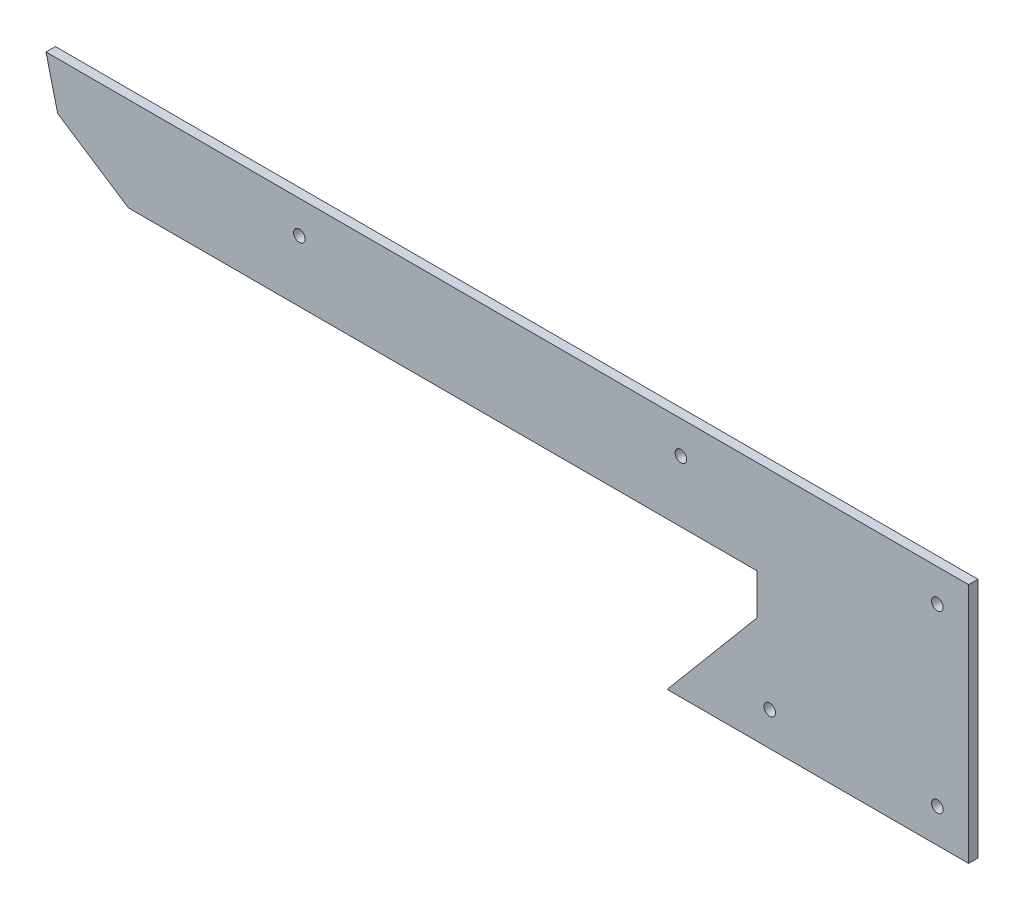
ISO-10303-21;
HEADER;
FILE_DESCRIPTION(('STEP AP214'),'2;1');
FILE_NAME('part.step','',(''),(''),'','','');
FILE_SCHEMA(('AUTOMOTIVE_DESIGN { 1 0 10303 214 1 1 1 1 }'));
ENDSEC;
DATA;
#1=APPLICATION_CONTEXT('core data for automotive mechanical design processes');
#2=APPLICATION_PROTOCOL_DEFINITION('international standard','automotive_design',2000,#1);
#3=PRODUCT_CONTEXT('',#1,'mechanical');
#4=PRODUCT('Part','Part','',(#3));
#5=PRODUCT_RELATED_PRODUCT_CATEGORY('part','',(#4));
#6=PRODUCT_DEFINITION_FORMATION('','',#4);
#7=PRODUCT_DEFINITION_CONTEXT('part definition',#1,'design');
#8=PRODUCT_DEFINITION('design','',#6,#7);
#9=PRODUCT_DEFINITION_SHAPE('','',#8);
#10=(LENGTH_UNIT() NAMED_UNIT(*) SI_UNIT(.MILLI.,.METRE.));
#11=(NAMED_UNIT(*) PLANE_ANGLE_UNIT() SI_UNIT($,.RADIAN.));
#12=(NAMED_UNIT(*) SI_UNIT($,.STERADIAN.) SOLID_ANGLE_UNIT());
#13=UNCERTAINTY_MEASURE_WITH_UNIT(LENGTH_MEASURE(1.E-05),#10,'distance_accuracy_value','');
#14=(GEOMETRIC_REPRESENTATION_CONTEXT(3) GLOBAL_UNCERTAINTY_ASSIGNED_CONTEXT((#13)) GLOBAL_UNIT_ASSIGNED_CONTEXT((#10,
#11,#12)) REPRESENTATION_CONTEXT('',''));
#15=CARTESIAN_POINT('',(0.,0.,0.));
#16=DIRECTION('',(0.,0.,1.));
#17=DIRECTION('',(1.,0.,0.));
#18=AXIS2_PLACEMENT_3D('',#15,#16,#17);
#19=CARTESIAN_POINT('',(0.,0.,15.));
#20=DIRECTION('',(0.,0.,-1.));
#21=DIRECTION('',(-1.,0.,0.));
#22=AXIS2_PLACEMENT_3D('',#19,#20,#21);
#23=PLANE('',#22);
#24=DIRECTION('',(0.239129123428334,-0.970987776611218,0.));
#25=VECTOR('',#24,1.);
#26=CARTESIAN_POINT('',(18.7206297064588,-76.0154277941144,15.));
#27=LINE('',#26,#25);
#28=CARTESIAN_POINT('',(0.,0.,15.));
#29=VERTEX_POINT('',#28);
#30=CARTESIAN_POINT('',(18.7206297064588,-76.0154277941144,15.));
#31=VERTEX_POINT('',#30);
#32=EDGE_CURVE('E150',#29,#31,#27,.T.);
#33=ORIENTED_EDGE('',*,*,#32,.T.);
#34=DIRECTION('',(0.836895874462482,-0.547362124473074,0.));
#35=VECTOR('',#34,1.);
#36=CARTESIAN_POINT('',(131.840227290203,-150.,15.));
#37=LINE('',#36,#35);
#38=CARTESIAN_POINT('',(131.840227290203,-150.,15.));
#39=VERTEX_POINT('',#38);
#40=EDGE_CURVE('E98',#31,#39,#37,.T.);
#41=ORIENTED_EDGE('',*,*,#40,.T.);
#42=DIRECTION('',(1.,0.,0.));
#43=VECTOR('',#42,1.);
#44=CARTESIAN_POINT('',(1136.8402272902,-150.,15.));
#45=LINE('',#44,#43);
#46=CARTESIAN_POINT('',(1136.8402272902,-150.,15.));
#47=VERTEX_POINT('',#46);
#48=EDGE_CURVE('E165',#39,#47,#45,.T.);
#49=ORIENTED_EDGE('',*,*,#48,.T.);
#50=DIRECTION('',(0.,-1.,0.));
#51=VECTOR('',#50,1.);
#52=CARTESIAN_POINT('',(1136.8402272902,-215.015424523064,15.));
#53=LINE('',#52,#51);
#54=CARTESIAN_POINT('',(1136.8402272902,-215.015424523064,15.));
#55=VERTEX_POINT('',#54);
#56=EDGE_CURVE('E178',#47,#55,#53,.T.);
#57=ORIENTED_EDGE('',*,*,#56,.T.);
#58=DIRECTION('',(-0.643576565083911,-0.765381738007116,0.));
#59=VECTOR('',#58,1.);
#60=CARTESIAN_POINT('',(993.066656138242,-386.,15.));
#61=LINE('',#60,#59);
#62=CARTESIAN_POINT('',(993.066656138242,-386.,15.));
#63=VERTEX_POINT('',#62);
#64=EDGE_CURVE('E117',#55,#63,#61,.T.);
#65=ORIENTED_EDGE('',*,*,#64,.T.);
#66=DIRECTION('',(1.,0.,0.));
#67=VECTOR('',#66,1.);
#68=CARTESIAN_POINT('',(1475.06665613824,-386.,15.));
#69=LINE('',#68,#67);
#70=CARTESIAN_POINT('',(1475.06665613824,-386.,15.));
#71=VERTEX_POINT('',#70);
#72=EDGE_CURVE('E111',#63,#71,#69,.T.);
#73=ORIENTED_EDGE('',*,*,#72,.T.);
#74=DIRECTION('',(0.,1.,0.));
#75=VECTOR('',#74,1.);
#76=CARTESIAN_POINT('',(1475.06665613824,0.,15.));
#77=LINE('',#76,#75);
#78=CARTESIAN_POINT('',(1475.06665613824,0.,15.));
#79=VERTEX_POINT('',#78);
#80=EDGE_CURVE('E115',#71,#79,#77,.T.);
#81=ORIENTED_EDGE('',*,*,#80,.T.);
#82=DIRECTION('',(-1.,0.,0.));
#83=VECTOR('',#82,1.);
#84=CARTESIAN_POINT('',(0.,0.,15.));
#85=LINE('',#84,#83);
#86=EDGE_CURVE('E55',#79,#29,#85,.T.);
#87=ORIENTED_EDGE('',*,*,#86,.T.);
#88=EDGE_LOOP('',(#33,#41,#49,#57,#65,#73,#81,#87));
#89=FACE_BOUND('',#88,.T.);
#90=CARTESIAN_POINT('',(405.066656138242,-52.,15.));
#91=DIRECTION('',(0.,0.,1.));
#92=DIRECTION('',(1.,0.,0.));
#93=AXIS2_PLACEMENT_3D('',#90,#91,#92);
#94=CIRCLE('',#93,9.24999999999999);
#95=CARTESIAN_POINT('',(414.316656138242,-52.,15.));
#96=VERTEX_POINT('',#95);
#97=EDGE_CURVE('E139',#96,#96,#94,.T.);
#98=ORIENTED_EDGE('',*,*,#97,.F.);
#99=EDGE_LOOP('',(#98));
#100=FACE_BOUND('',#99,.T.);
#101=CARTESIAN_POINT('',(1015.06665613824,-52.,15.));
#102=DIRECTION('',(0.,0.,1.));
#103=DIRECTION('',(1.,0.,0.));
#104=AXIS2_PLACEMENT_3D('',#101,#102,#103);
#105=CIRCLE('',#104,9.25000000000005);
#106=CARTESIAN_POINT('',(1024.31665613824,-52.,15.));
#107=VERTEX_POINT('',#106);
#108=EDGE_CURVE('E187',#107,#107,#105,.T.);
#109=ORIENTED_EDGE('',*,*,#108,.F.);
#110=EDGE_LOOP('',(#109));
#111=FACE_BOUND('',#110,.T.);
#112=CARTESIAN_POINT('',(1425.06665613824,-332.,15.));
#113=DIRECTION('',(0.,0.,1.));
#114=DIRECTION('',(1.,0.,0.));
#115=AXIS2_PLACEMENT_3D('',#112,#113,#114);
#116=CIRCLE('',#115,9.25000000000005);
#117=CARTESIAN_POINT('',(1434.31665613824,-332.,15.));
#118=VERTEX_POINT('',#117);
#119=EDGE_CURVE('E193',#118,#118,#116,.T.);
#120=ORIENTED_EDGE('',*,*,#119,.F.);
#121=EDGE_LOOP('',(#120));
#122=FACE_BOUND('',#121,.T.);
#123=CARTESIAN_POINT('',(1425.06665613824,-52.,15.));
#124=DIRECTION('',(0.,0.,1.));
#125=DIRECTION('',(1.,0.,0.));
#126=AXIS2_PLACEMENT_3D('',#123,#124,#125);
#127=CIRCLE('',#126,9.25000000000005);
#128=CARTESIAN_POINT('',(1434.31665613824,-52.,15.));
#129=VERTEX_POINT('',#128);
#130=EDGE_CURVE('E199',#129,#129,#127,.T.);
#131=ORIENTED_EDGE('',*,*,#130,.F.);
#132=EDGE_LOOP('',(#131));
#133=FACE_BOUND('',#132,.T.);
#134=CARTESIAN_POINT('',(1157.06665613824,-332.,15.));
#135=DIRECTION('',(0.,0.,1.));
#136=DIRECTION('',(1.,0.,0.));
#137=AXIS2_PLACEMENT_3D('',#134,#135,#136);
#138=CIRCLE('',#137,9.25000000000005);
#139=CARTESIAN_POINT('',(1166.31665613824,-332.,15.));
#140=VERTEX_POINT('',#139);
#141=EDGE_CURVE('E205',#140,#140,#138,.T.);
#142=ORIENTED_EDGE('',*,*,#141,.F.);
#143=EDGE_LOOP('',(#142));
#144=FACE_BOUND('',#143,.T.);
#145=ADVANCED_FACE('F38',(#89,#100,#111,#122,#133,#144),#23,.F.);
#146=CARTESIAN_POINT('',(0.,0.,0.));
#147=DIRECTION('',(0.,0.,-1.));
#148=DIRECTION('',(-1.,0.,0.));
#149=AXIS2_PLACEMENT_3D('',#146,#147,#148);
#150=PLANE('',#149);
#151=CARTESIAN_POINT('',(1425.06665613824,-52.,0.));
#152=DIRECTION('',(0.,0.,1.));
#153=DIRECTION('',(1.,0.,0.));
#154=AXIS2_PLACEMENT_3D('',#151,#152,#153);
#155=CIRCLE('',#154,9.25000000000005);
#156=CARTESIAN_POINT('',(1434.31665613824,-52.,0.));
#157=VERTEX_POINT('',#156);
#158=EDGE_CURVE('E202',#157,#157,#155,.T.);
#159=ORIENTED_EDGE('',*,*,#158,.T.);
#160=EDGE_LOOP('',(#159));
#161=FACE_BOUND('',#160,.T.);
#162=CARTESIAN_POINT('',(1015.06665613824,-52.,0.));
#163=DIRECTION('',(0.,0.,1.));
#164=DIRECTION('',(1.,0.,0.));
#165=AXIS2_PLACEMENT_3D('',#162,#163,#164);
#166=CIRCLE('',#165,9.25000000000005);
#167=CARTESIAN_POINT('',(1024.31665613824,-52.,0.));
#168=VERTEX_POINT('',#167);
#169=EDGE_CURVE('E190',#168,#168,#166,.T.);
#170=ORIENTED_EDGE('',*,*,#169,.T.);
#171=EDGE_LOOP('',(#170));
#172=FACE_BOUND('',#171,.T.);
#173=DIRECTION('',(0.239129123428334,-0.970987776611218,0.));
#174=VECTOR('',#173,1.);
#175=CARTESIAN_POINT('',(18.7206297064588,-76.0154277941144,0.));
#176=LINE('',#175,#174);
#177=CARTESIAN_POINT('',(0.,0.,0.));
#178=VERTEX_POINT('',#177);
#179=CARTESIAN_POINT('',(18.7206297064588,-76.0154277941144,0.));
#180=VERTEX_POINT('',#179);
#181=EDGE_CURVE('E135',#178,#180,#176,.T.);
#182=ORIENTED_EDGE('',*,*,#181,.F.);
#183=DIRECTION('',(-1.,0.,0.));
#184=VECTOR('',#183,1.);
#185=CARTESIAN_POINT('',(0.,0.,0.));
#186=LINE('',#185,#184);
#187=CARTESIAN_POINT('',(1475.06665613824,0.,0.));
#188=VERTEX_POINT('',#187);
#189=EDGE_CURVE('E90',#188,#178,#186,.T.);
#190=ORIENTED_EDGE('',*,*,#189,.F.);
#191=DIRECTION('',(0.,1.,0.));
#192=VECTOR('',#191,1.);
#193=CARTESIAN_POINT('',(1475.06665613824,0.,0.));
#194=LINE('',#193,#192);
#195=CARTESIAN_POINT('',(1475.06665613824,-386.,0.));
#196=VERTEX_POINT('',#195);
#197=EDGE_CURVE('E84',#196,#188,#194,.T.);
#198=ORIENTED_EDGE('',*,*,#197,.F.);
#199=DIRECTION('',(1.,0.,0.));
#200=VECTOR('',#199,1.);
#201=CARTESIAN_POINT('',(1475.06665613824,-386.,0.));
#202=LINE('',#201,#200);
#203=CARTESIAN_POINT('',(993.066656138242,-386.,0.));
#204=VERTEX_POINT('',#203);
#205=EDGE_CURVE('E125',#204,#196,#202,.T.);
#206=ORIENTED_EDGE('',*,*,#205,.F.);
#207=DIRECTION('',(-0.643576565083911,-0.765381738007116,0.));
#208=VECTOR('',#207,1.);
#209=CARTESIAN_POINT('',(993.066656138242,-386.,0.));
#210=LINE('',#209,#208);
#211=CARTESIAN_POINT('',(1136.8402272902,-215.015424523064,0.));
#212=VERTEX_POINT('',#211);
#213=EDGE_CURVE('E145',#212,#204,#210,.T.);
#214=ORIENTED_EDGE('',*,*,#213,.F.);
#215=DIRECTION('',(0.,-1.,0.));
#216=VECTOR('',#215,1.);
#217=CARTESIAN_POINT('',(1136.8402272902,-215.015424523064,0.));
#218=LINE('',#217,#216);
#219=CARTESIAN_POINT('',(1136.8402272902,-150.,0.));
#220=VERTEX_POINT('',#219);
#221=EDGE_CURVE('E143',#220,#212,#218,.T.);
#222=ORIENTED_EDGE('',*,*,#221,.F.);
#223=DIRECTION('',(1.,0.,0.));
#224=VECTOR('',#223,1.);
#225=CARTESIAN_POINT('',(1136.8402272902,-150.,0.));
#226=LINE('',#225,#224);
#227=CARTESIAN_POINT('',(131.840227290203,-150.,0.));
#228=VERTEX_POINT('',#227);
#229=EDGE_CURVE('E141',#228,#220,#226,.T.);
#230=ORIENTED_EDGE('',*,*,#229,.F.);
#231=DIRECTION('',(0.836895874462482,-0.547362124473074,0.));
#232=VECTOR('',#231,1.);
#233=CARTESIAN_POINT('',(131.840227290203,-150.,0.));
#234=LINE('',#233,#232);
#235=EDGE_CURVE('E138',#180,#228,#234,.T.);
#236=ORIENTED_EDGE('',*,*,#235,.F.);
#237=EDGE_LOOP('',(#182,#190,#198,#206,#214,#222,#230,#236));
#238=FACE_BOUND('',#237,.T.);
#239=CARTESIAN_POINT('',(405.066656138242,-52.,0.));
#240=DIRECTION('',(0.,0.,1.));
#241=DIRECTION('',(1.,0.,0.));
#242=AXIS2_PLACEMENT_3D('',#239,#240,#241);
#243=CIRCLE('',#242,9.24999999999999);
#244=CARTESIAN_POINT('',(414.316656138242,-52.,0.));
#245=VERTEX_POINT('',#244);
#246=EDGE_CURVE('E184',#245,#245,#243,.T.);
#247=ORIENTED_EDGE('',*,*,#246,.T.);
#248=EDGE_LOOP('',(#247));
#249=FACE_BOUND('',#248,.T.);
#250=CARTESIAN_POINT('',(1425.06665613824,-332.,0.));
#251=DIRECTION('',(0.,0.,1.));
#252=DIRECTION('',(1.,0.,0.));
#253=AXIS2_PLACEMENT_3D('',#250,#251,#252);
#254=CIRCLE('',#253,9.25000000000005);
#255=CARTESIAN_POINT('',(1434.31665613824,-332.,0.));
#256=VERTEX_POINT('',#255);
#257=EDGE_CURVE('E196',#256,#256,#254,.T.);
#258=ORIENTED_EDGE('',*,*,#257,.T.);
#259=EDGE_LOOP('',(#258));
#260=FACE_BOUND('',#259,.T.);
#261=CARTESIAN_POINT('',(1157.06665613824,-332.,0.));
#262=DIRECTION('',(0.,0.,1.));
#263=DIRECTION('',(1.,0.,0.));
#264=AXIS2_PLACEMENT_3D('',#261,#262,#263);
#265=CIRCLE('',#264,9.25000000000005);
#266=CARTESIAN_POINT('',(1166.31665613824,-332.,0.));
#267=VERTEX_POINT('',#266);
#268=EDGE_CURVE('E208',#267,#267,#265,.T.);
#269=ORIENTED_EDGE('',*,*,#268,.T.);
#270=EDGE_LOOP('',(#269));
#271=FACE_BOUND('',#270,.T.);
#272=ADVANCED_FACE('F169',(#161,#172,#238,#249,#260,#271),#150,.T.);
#273=CARTESIAN_POINT('',(18.7206297064588,-76.0154277941144,15.));
#274=DIRECTION('',(0.970987776611218,0.239129123428334,0.));
#275=DIRECTION('',(-0.239129123428334,0.970987776611218,0.));
#276=AXIS2_PLACEMENT_3D('',#273,#274,#275);
#277=PLANE('',#276);
#278=ORIENTED_EDGE('',*,*,#181,.T.);
#279=DIRECTION('',(0.,0.,-1.));
#280=VECTOR('',#279,1.);
#281=CARTESIAN_POINT('',(18.7206297064588,-76.0154277941144,15.));
#282=LINE('',#281,#280);
#283=EDGE_CURVE('E11',#31,#180,#282,.T.);
#284=ORIENTED_EDGE('',*,*,#283,.F.);
#285=ORIENTED_EDGE('',*,*,#32,.F.);
#286=DIRECTION('',(0.,0.,-1.));
#287=VECTOR('',#286,1.);
#288=CARTESIAN_POINT('',(0.,0.,15.));
#289=LINE('',#288,#287);
#290=EDGE_CURVE('E131',#29,#178,#289,.T.);
#291=ORIENTED_EDGE('',*,*,#290,.T.);
#292=EDGE_LOOP('',(#278,#284,#285,#291));
#293=FACE_BOUND('',#292,.T.);
#294=ADVANCED_FACE('F40',(#293),#277,.F.);
#295=CARTESIAN_POINT('',(131.840227290203,-150.,15.));
#296=DIRECTION('',(0.547362124473074,0.836895874462482,0.));
#297=DIRECTION('',(-0.836895874462482,0.547362124473074,0.));
#298=AXIS2_PLACEMENT_3D('',#295,#296,#297);
#299=PLANE('',#298);
#300=ORIENTED_EDGE('',*,*,#235,.T.);
#301=DIRECTION('',(0.,0.,-1.));
#302=VECTOR('',#301,1.);
#303=CARTESIAN_POINT('',(131.840227290203,-150.,15.));
#304=LINE('',#303,#302);
#305=EDGE_CURVE('E47',#39,#228,#304,.T.);
#306=ORIENTED_EDGE('',*,*,#305,.F.);
#307=ORIENTED_EDGE('',*,*,#40,.F.);
#308=ORIENTED_EDGE('',*,*,#283,.T.);
#309=EDGE_LOOP('',(#300,#306,#307,#308));
#310=FACE_BOUND('',#309,.T.);
#311=ADVANCED_FACE('F240',(#310),#299,.F.);
#312=CARTESIAN_POINT('',(1136.8402272902,-150.,15.));
#313=DIRECTION('',(0.,1.,0.));
#314=DIRECTION('',(0.,0.,1.));
#315=AXIS2_PLACEMENT_3D('',#312,#313,#314);
#316=PLANE('',#315);
#317=ORIENTED_EDGE('',*,*,#229,.T.);
#318=DIRECTION('',(0.,0.,-1.));
#319=VECTOR('',#318,1.);
#320=CARTESIAN_POINT('',(1136.8402272902,-150.,15.));
#321=LINE('',#320,#319);
#322=EDGE_CURVE('E157',#47,#220,#321,.T.);
#323=ORIENTED_EDGE('',*,*,#322,.F.);
#324=ORIENTED_EDGE('',*,*,#48,.F.);
#325=ORIENTED_EDGE('',*,*,#305,.T.);
#326=EDGE_LOOP('',(#317,#323,#324,#325));
#327=FACE_BOUND('',#326,.T.);
#328=ADVANCED_FACE('F163',(#327),#316,.F.);
#329=CARTESIAN_POINT('',(1136.8402272902,-215.015424523064,15.));
#330=DIRECTION('',(1.,0.,0.));
#331=DIRECTION('',(0.,0.,-1.));
#332=AXIS2_PLACEMENT_3D('',#329,#330,#331);
#333=PLANE('',#332);
#334=ORIENTED_EDGE('',*,*,#221,.T.);
#335=DIRECTION('',(0.,0.,-1.));
#336=VECTOR('',#335,1.);
#337=CARTESIAN_POINT('',(1136.8402272902,-215.015424523064,15.));
#338=LINE('',#337,#336);
#339=EDGE_CURVE('E154',#55,#212,#338,.T.);
#340=ORIENTED_EDGE('',*,*,#339,.F.);
#341=ORIENTED_EDGE('',*,*,#56,.F.);
#342=ORIENTED_EDGE('',*,*,#322,.T.);
#343=EDGE_LOOP('',(#334,#340,#341,#342));
#344=FACE_BOUND('',#343,.T.);
#345=ADVANCED_FACE('F174',(#344),#333,.F.);
#346=CARTESIAN_POINT('',(993.066656138242,-386.,15.));
#347=DIRECTION('',(0.765381738007116,-0.643576565083911,0.));
#348=DIRECTION('',(0.643576565083911,0.765381738007116,0.));
#349=AXIS2_PLACEMENT_3D('',#346,#347,#348);
#350=PLANE('',#349);
#351=ORIENTED_EDGE('',*,*,#213,.T.);
#352=DIRECTION('',(0.,0.,-1.));
#353=VECTOR('',#352,1.);
#354=CARTESIAN_POINT('',(993.066656138242,-386.,15.));
#355=LINE('',#354,#353);
#356=EDGE_CURVE('E126',#63,#204,#355,.T.);
#357=ORIENTED_EDGE('',*,*,#356,.F.);
#358=ORIENTED_EDGE('',*,*,#64,.F.);
#359=ORIENTED_EDGE('',*,*,#339,.T.);
#360=EDGE_LOOP('',(#351,#357,#358,#359));
#361=FACE_BOUND('',#360,.T.);
#362=ADVANCED_FACE('F177',(#361),#350,.F.);
#363=CARTESIAN_POINT('',(1475.06665613824,-386.,15.));
#364=DIRECTION('',(0.,1.,0.));
#365=DIRECTION('',(-1.,0.,0.));
#366=AXIS2_PLACEMENT_3D('',#363,#364,#365);
#367=PLANE('',#366);
#368=ORIENTED_EDGE('',*,*,#205,.T.);
#369=DIRECTION('',(0.,0.,-1.));
#370=VECTOR('',#369,1.);
#371=CARTESIAN_POINT('',(1475.06665613824,-386.,15.));
#372=LINE('',#371,#370);
#373=EDGE_CURVE('E122',#71,#196,#372,.T.);
#374=ORIENTED_EDGE('',*,*,#373,.F.);
#375=ORIENTED_EDGE('',*,*,#72,.F.);
#376=ORIENTED_EDGE('',*,*,#356,.T.);
#377=EDGE_LOOP('',(#368,#374,#375,#376));
#378=FACE_BOUND('',#377,.T.);
#379=ADVANCED_FACE('F123',(#378),#367,.F.);
#380=CARTESIAN_POINT('',(1475.06665613824,0.,15.));
#381=DIRECTION('',(-1.,0.,0.));
#382=DIRECTION('',(0.,0.,1.));
#383=AXIS2_PLACEMENT_3D('',#380,#381,#382);
#384=PLANE('',#383);
#385=ORIENTED_EDGE('',*,*,#197,.T.);
#386=DIRECTION('',(0.,0.,-1.));
#387=VECTOR('',#386,1.);
#388=CARTESIAN_POINT('',(1475.06665613824,0.,15.));
#389=LINE('',#388,#387);
#390=EDGE_CURVE('E127',#79,#188,#389,.T.);
#391=ORIENTED_EDGE('',*,*,#390,.F.);
#392=ORIENTED_EDGE('',*,*,#80,.F.);
#393=ORIENTED_EDGE('',*,*,#373,.T.);
#394=EDGE_LOOP('',(#385,#391,#392,#393));
#395=FACE_BOUND('',#394,.T.);
#396=ADVANCED_FACE('F129',(#395),#384,.F.);
#397=CARTESIAN_POINT('',(0.,0.,15.));
#398=DIRECTION('',(0.,-1.,0.));
#399=DIRECTION('',(0.,0.,-1.));
#400=AXIS2_PLACEMENT_3D('',#397,#398,#399);
#401=PLANE('',#400);
#402=ORIENTED_EDGE('',*,*,#189,.T.);
#403=ORIENTED_EDGE('',*,*,#290,.F.);
#404=ORIENTED_EDGE('',*,*,#86,.F.);
#405=ORIENTED_EDGE('',*,*,#390,.T.);
#406=EDGE_LOOP('',(#402,#403,#404,#405));
#407=FACE_BOUND('',#406,.T.);
#408=ADVANCED_FACE('F228',(#407),#401,.F.);
#409=CARTESIAN_POINT('',(405.066656138242,-52.,15.));
#410=DIRECTION('',(0.,0.,-1.));
#411=DIRECTION('',(-1.,0.,0.));
#412=AXIS2_PLACEMENT_3D('',#409,#410,#411);
#413=CYLINDRICAL_SURFACE('',#412,9.24999999999999);
#414=ORIENTED_EDGE('',*,*,#97,.T.);
#415=EDGE_LOOP('',(#414));
#416=FACE_BOUND('',#415,.T.);
#417=ORIENTED_EDGE('',*,*,#246,.F.);
#418=EDGE_LOOP('',(#417));
#419=FACE_BOUND('',#418,.T.);
#420=ADVANCED_FACE('F225',(#416,#419),#413,.F.);
#421=CARTESIAN_POINT('',(1015.06665613824,-52.,15.));
#422=DIRECTION('',(0.,0.,-1.));
#423=DIRECTION('',(-1.,0.,0.));
#424=AXIS2_PLACEMENT_3D('',#421,#422,#423);
#425=CYLINDRICAL_SURFACE('',#424,9.25000000000005);
#426=ORIENTED_EDGE('',*,*,#108,.T.);
#427=EDGE_LOOP('',(#426));
#428=FACE_BOUND('',#427,.T.);
#429=ORIENTED_EDGE('',*,*,#169,.F.);
#430=EDGE_LOOP('',(#429));
#431=FACE_BOUND('',#430,.T.);
#432=ADVANCED_FACE('F316',(#428,#431),#425,.F.);
#433=CARTESIAN_POINT('',(1425.06665613824,-332.,15.));
#434=DIRECTION('',(0.,0.,-1.));
#435=DIRECTION('',(-1.,0.,0.));
#436=AXIS2_PLACEMENT_3D('',#433,#434,#435);
#437=CYLINDRICAL_SURFACE('',#436,9.25000000000005);
#438=ORIENTED_EDGE('',*,*,#119,.T.);
#439=EDGE_LOOP('',(#438));
#440=FACE_BOUND('',#439,.T.);
#441=ORIENTED_EDGE('',*,*,#257,.F.);
#442=EDGE_LOOP('',(#441));
#443=FACE_BOUND('',#442,.T.);
#444=ADVANCED_FACE('F325',(#440,#443),#437,.F.);
#445=CARTESIAN_POINT('',(1425.06665613824,-52.,15.));
#446=DIRECTION('',(0.,0.,-1.));
#447=DIRECTION('',(-1.,0.,0.));
#448=AXIS2_PLACEMENT_3D('',#445,#446,#447);
#449=CYLINDRICAL_SURFACE('',#448,9.25000000000005);
#450=ORIENTED_EDGE('',*,*,#130,.T.);
#451=EDGE_LOOP('',(#450));
#452=FACE_BOUND('',#451,.T.);
#453=ORIENTED_EDGE('',*,*,#158,.F.);
#454=EDGE_LOOP('',(#453));
#455=FACE_BOUND('',#454,.T.);
#456=ADVANCED_FACE('F334',(#452,#455),#449,.F.);
#457=CARTESIAN_POINT('',(1157.06665613824,-332.,15.));
#458=DIRECTION('',(0.,0.,-1.));
#459=DIRECTION('',(-1.,0.,0.));
#460=AXIS2_PLACEMENT_3D('',#457,#458,#459);
#461=CYLINDRICAL_SURFACE('',#460,9.25000000000005);
#462=ORIENTED_EDGE('',*,*,#141,.T.);
#463=EDGE_LOOP('',(#462));
#464=FACE_BOUND('',#463,.T.);
#465=ORIENTED_EDGE('',*,*,#268,.F.);
#466=EDGE_LOOP('',(#465));
#467=FACE_BOUND('',#466,.T.);
#468=ADVANCED_FACE('F214',(#464,#467),#461,.F.);
#469=CLOSED_SHELL('',(#145,#272,#294,#311,#328,#345,#362,#379,#396,#408,#420,#432,#444,#456,#468));
#470=MANIFOLD_SOLID_BREP('B2',#469);
#471=ADVANCED_BREP_SHAPE_REPRESENTATION('',(#18,#470),#14);
#472=SHAPE_DEFINITION_REPRESENTATION(#9,#471);
ENDSEC;
END-ISO-10303-21;
